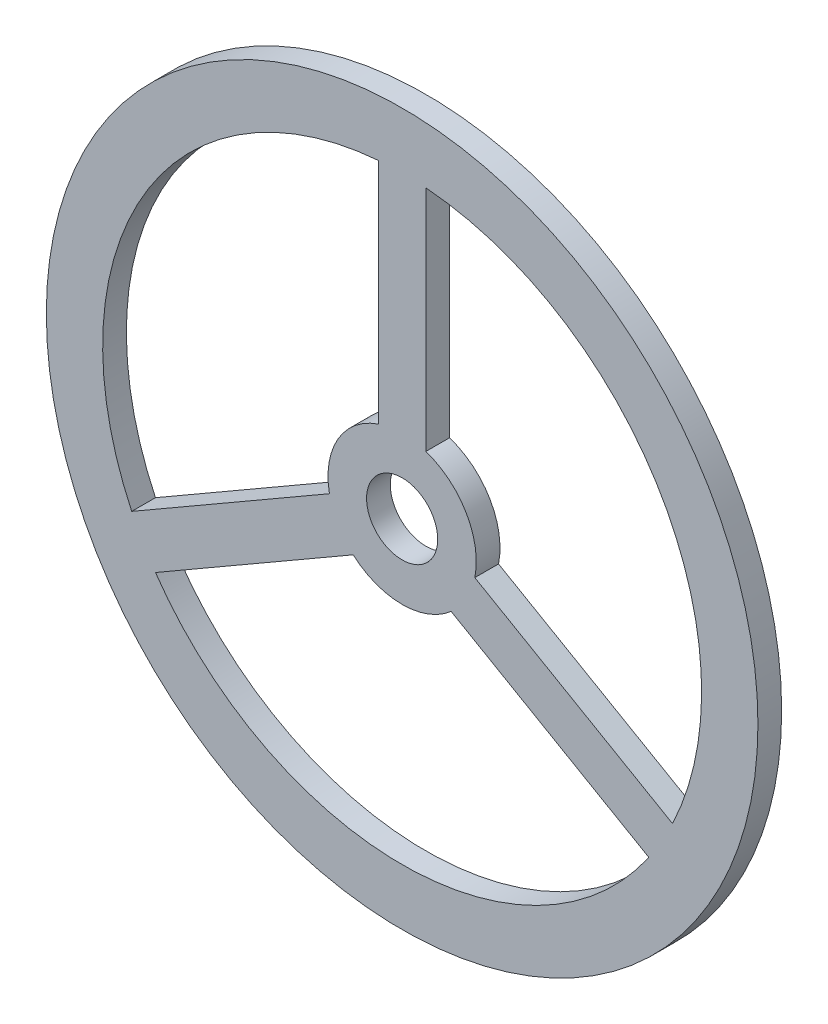
ISO-10303-21;
HEADER;
FILE_DESCRIPTION(('STEP AP214'),'2;1');
FILE_NAME('part.step','',(''),(''),'','','');
FILE_SCHEMA(('AUTOMOTIVE_DESIGN { 1 0 10303 214 1 1 1 1 }'));
ENDSEC;
DATA;
#1=APPLICATION_CONTEXT('core data for automotive mechanical design processes');
#2=APPLICATION_PROTOCOL_DEFINITION('international standard','automotive_design',2000,#1);
#3=PRODUCT_CONTEXT('',#1,'mechanical');
#4=PRODUCT('Part','Part','',(#3));
#5=PRODUCT_RELATED_PRODUCT_CATEGORY('part','',(#4));
#6=PRODUCT_DEFINITION_FORMATION('','',#4);
#7=PRODUCT_DEFINITION_CONTEXT('part definition',#1,'design');
#8=PRODUCT_DEFINITION('design','',#6,#7);
#9=PRODUCT_DEFINITION_SHAPE('','',#8);
#10=(LENGTH_UNIT() NAMED_UNIT(*) SI_UNIT(.MILLI.,.METRE.));
#11=(NAMED_UNIT(*) PLANE_ANGLE_UNIT() SI_UNIT($,.RADIAN.));
#12=(NAMED_UNIT(*) SI_UNIT($,.STERADIAN.) SOLID_ANGLE_UNIT());
#13=UNCERTAINTY_MEASURE_WITH_UNIT(LENGTH_MEASURE(1.E-05),#10,'distance_accuracy_value','');
#14=(GEOMETRIC_REPRESENTATION_CONTEXT(3) GLOBAL_UNCERTAINTY_ASSIGNED_CONTEXT((#13)) GLOBAL_UNIT_ASSIGNED_CONTEXT((#10,
#11,#12)) REPRESENTATION_CONTEXT('',''));
#15=CARTESIAN_POINT('',(0.,0.,0.));
#16=DIRECTION('',(0.,0.,1.));
#17=DIRECTION('',(1.,0.,0.));
#18=AXIS2_PLACEMENT_3D('',#15,#16,#17);
#19=CARTESIAN_POINT('',(0.,0.,4.));
#20=DIRECTION('',(0.,0.,1.));
#21=DIRECTION('',(1.,0.,0.));
#22=AXIS2_PLACEMENT_3D('',#19,#20,#21);
#23=PLANE('',#22);
#24=CARTESIAN_POINT('',(0.,0.,4.));
#25=DIRECTION('',(0.,0.,1.));
#26=DIRECTION('',(1.,0.,0.));
#27=AXIS2_PLACEMENT_3D('',#24,#25,#26);
#28=CIRCLE('',#27,60.);
#29=CARTESIAN_POINT('',(60.,0.,4.));
#30=VERTEX_POINT('',#29);
#31=EDGE_CURVE('E11',#30,#30,#28,.T.);
#32=ORIENTED_EDGE('',*,*,#31,.T.);
#33=EDGE_LOOP('',(#32));
#34=FACE_BOUND('',#33,.T.);
#35=CARTESIAN_POINT('',(0.,0.,4.));
#36=DIRECTION('',(0.,0.,1.));
#37=DIRECTION('',(1.,0.,0.));
#38=AXIS2_PLACEMENT_3D('',#35,#36,#37);
#39=CIRCLE('',#38,6.);
#40=CARTESIAN_POINT('',(6.,0.,4.));
#41=VERTEX_POINT('',#40);
#42=EDGE_CURVE('E219',#41,#41,#39,.T.);
#43=ORIENTED_EDGE('',*,*,#42,.F.);
#44=EDGE_LOOP('',(#43));
#45=FACE_BOUND('',#44,.T.);
#46=DIRECTION('',(0.,1.,0.));
#47=VECTOR('',#46,1.);
#48=CARTESIAN_POINT('',(-4.,11.842719282327,4.));
#49=LINE('',#48,#47);
#50=CARTESIAN_POINT('',(-4.,11.842719282327,4.));
#51=VERTEX_POINT('',#50);
#52=CARTESIAN_POINT('',(-4.,50.3413349048275,4.));
#53=VERTEX_POINT('',#52);
#54=EDGE_CURVE('E190',#51,#53,#49,.T.);
#55=ORIENTED_EDGE('',*,*,#54,.F.);
#56=CARTESIAN_POINT('',(0.,0.,4.));
#57=DIRECTION('',(0.,0.,-1.));
#58=DIRECTION('',(1.,0.,0.));
#59=AXIS2_PLACEMENT_3D('',#56,#57,#58);
#60=CIRCLE('',#59,12.5);
#61=CARTESIAN_POINT('',(-12.256095748383,-2.45725802602564,4.));
#62=VERTEX_POINT('',#61);
#63=EDGE_CURVE('E188',#62,#51,#60,.T.);
#64=ORIENTED_EDGE('',*,*,#63,.F.);
#65=DIRECTION('',(0.866025403784437,0.500000000000003,0.));
#66=VECTOR('',#65,1.);
#67=CARTESIAN_POINT('',(-12.256095748383,-2.45725802602564,4.));
#68=LINE('',#67,#66);
#69=CARTESIAN_POINT('',(-45.5968748880008,-21.706565837276,4.));
#70=VERTEX_POINT('',#69);
#71=EDGE_CURVE('E196',#70,#62,#68,.T.);
#72=ORIENTED_EDGE('',*,*,#71,.F.);
#73=CARTESIAN_POINT('',(0.,0.,4.));
#74=DIRECTION('',(0.,0.,1.));
#75=DIRECTION('',(1.,0.,0.));
#76=AXIS2_PLACEMENT_3D('',#73,#74,#75);
#77=CIRCLE('',#76,50.5);
#78=EDGE_CURVE('E193',#53,#70,#77,.T.);
#79=ORIENTED_EDGE('',*,*,#78,.F.);
#80=EDGE_LOOP('',(#55,#64,#72,#79));
#81=FACE_BOUND('',#80,.T.);
#82=DIRECTION('',(0.866025403784439,-0.499999999999998,0.));
#83=VECTOR('',#82,1.);
#84=CARTESIAN_POINT('',(12.256095748383,-2.45725802602581,4.));
#85=LINE('',#84,#83);
#86=CARTESIAN_POINT('',(12.256095748383,-2.45725802602581,4.));
#87=VERTEX_POINT('',#86);
#88=CARTESIAN_POINT('',(45.5968748880009,-21.706565837276,4.));
#89=VERTEX_POINT('',#88);
#90=EDGE_CURVE('E159',#87,#89,#85,.T.);
#91=ORIENTED_EDGE('',*,*,#90,.F.);
#92=CARTESIAN_POINT('',(0.,0.,4.));
#93=DIRECTION('',(0.,0.,-1.));
#94=DIRECTION('',(1.,0.,0.));
#95=AXIS2_PLACEMENT_3D('',#92,#93,#94);
#96=CIRCLE('',#95,12.5);
#97=CARTESIAN_POINT('',(4.,11.842719282327,4.));
#98=VERTEX_POINT('',#97);
#99=EDGE_CURVE('E157',#98,#87,#96,.T.);
#100=ORIENTED_EDGE('',*,*,#99,.F.);
#101=DIRECTION('',(0.,-1.,0.));
#102=VECTOR('',#101,1.);
#103=CARTESIAN_POINT('',(4.,11.842719282327,4.));
#104=LINE('',#103,#102);
#105=CARTESIAN_POINT('',(4.,50.3413349048275,4.));
#106=VERTEX_POINT('',#105);
#107=EDGE_CURVE('E165',#106,#98,#104,.T.);
#108=ORIENTED_EDGE('',*,*,#107,.F.);
#109=CARTESIAN_POINT('',(0.,0.,4.));
#110=DIRECTION('',(0.,0.,1.));
#111=DIRECTION('',(1.,0.,0.));
#112=AXIS2_PLACEMENT_3D('',#109,#110,#111);
#113=CIRCLE('',#112,50.5);
#114=EDGE_CURVE('E162',#89,#106,#113,.T.);
#115=ORIENTED_EDGE('',*,*,#114,.F.);
#116=EDGE_LOOP('',(#91,#100,#108,#115));
#117=FACE_BOUND('',#116,.T.);
#118=DIRECTION('',(-0.866025403784437,-0.500000000000003,0.));
#119=VECTOR('',#118,1.);
#120=CARTESIAN_POINT('',(-8.2560957483831,-9.38546125630118,4.));
#121=LINE('',#120,#119);
#122=CARTESIAN_POINT('',(-8.2560957483831,-9.38546125630118,4.));
#123=VERTEX_POINT('',#122);
#124=CARTESIAN_POINT('',(-41.5968748880009,-28.6347690675515,4.));
#125=VERTEX_POINT('',#124);
#126=EDGE_CURVE('E129',#123,#125,#121,.T.);
#127=ORIENTED_EDGE('',*,*,#126,.F.);
#128=CARTESIAN_POINT('',(0.,0.,4.));
#129=DIRECTION('',(0.,0.,-1.));
#130=DIRECTION('',(1.,0.,0.));
#131=AXIS2_PLACEMENT_3D('',#128,#129,#130);
#132=CIRCLE('',#131,12.5);
#133=CARTESIAN_POINT('',(8.25609574838296,-9.3854612563013,4.));
#134=VERTEX_POINT('',#133);
#135=EDGE_CURVE('E121',#134,#123,#132,.T.);
#136=ORIENTED_EDGE('',*,*,#135,.F.);
#137=DIRECTION('',(-0.86602540378444,0.499999999999998,0.));
#138=VECTOR('',#137,1.);
#139=CARTESIAN_POINT('',(8.25609574838296,-9.3854612563013,4.));
#140=LINE('',#139,#138);
#141=CARTESIAN_POINT('',(41.5968748880009,-28.6347690675515,4.));
#142=VERTEX_POINT('',#141);
#143=EDGE_CURVE('E143',#142,#134,#140,.T.);
#144=ORIENTED_EDGE('',*,*,#143,.F.);
#145=CARTESIAN_POINT('',(0.,0.,4.));
#146=DIRECTION('',(0.,0.,1.));
#147=DIRECTION('',(1.,0.,0.));
#148=AXIS2_PLACEMENT_3D('',#145,#146,#147);
#149=CIRCLE('',#148,50.5);
#150=EDGE_CURVE('E141',#125,#142,#149,.T.);
#151=ORIENTED_EDGE('',*,*,#150,.F.);
#152=EDGE_LOOP('',(#127,#136,#144,#151));
#153=FACE_BOUND('',#152,.T.);
#154=ADVANCED_FACE('F32',(#34,#45,#81,#117,#153),#23,.T.);
#155=CARTESIAN_POINT('',(0.,0.,0.));
#156=DIRECTION('',(0.,0.,1.));
#157=DIRECTION('',(1.,0.,0.));
#158=AXIS2_PLACEMENT_3D('',#155,#156,#157);
#159=PLANE('',#158);
#160=CARTESIAN_POINT('',(0.,0.,0.));
#161=DIRECTION('',(0.,0.,-1.));
#162=DIRECTION('',(1.,0.,0.));
#163=AXIS2_PLACEMENT_3D('',#160,#161,#162);
#164=CIRCLE('',#163,12.5);
#165=CARTESIAN_POINT('',(4.,11.842719282327,0.));
#166=VERTEX_POINT('',#165);
#167=CARTESIAN_POINT('',(12.256095748383,-2.45725802602581,0.));
#168=VERTEX_POINT('',#167);
#169=EDGE_CURVE('E137',#166,#168,#164,.T.);
#170=ORIENTED_EDGE('',*,*,#169,.T.);
#171=DIRECTION('',(0.866025403784439,-0.499999999999998,0.));
#172=VECTOR('',#171,1.);
#173=CARTESIAN_POINT('',(12.256095748383,-2.45725802602581,0.));
#174=LINE('',#173,#172);
#175=CARTESIAN_POINT('',(45.5968748880009,-21.706565837276,0.));
#176=VERTEX_POINT('',#175);
#177=EDGE_CURVE('E170',#168,#176,#174,.T.);
#178=ORIENTED_EDGE('',*,*,#177,.T.);
#179=CARTESIAN_POINT('',(0.,0.,0.));
#180=DIRECTION('',(0.,0.,1.));
#181=DIRECTION('',(1.,0.,0.));
#182=AXIS2_PLACEMENT_3D('',#179,#180,#181);
#183=CIRCLE('',#182,50.5);
#184=CARTESIAN_POINT('',(4.,50.3413349048275,0.));
#185=VERTEX_POINT('',#184);
#186=EDGE_CURVE('E173',#176,#185,#183,.T.);
#187=ORIENTED_EDGE('',*,*,#186,.T.);
#188=DIRECTION('',(0.,-1.,0.));
#189=VECTOR('',#188,1.);
#190=CARTESIAN_POINT('',(4.,11.842719282327,0.));
#191=LINE('',#190,#189);
#192=EDGE_CURVE('E160',#185,#166,#191,.T.);
#193=ORIENTED_EDGE('',*,*,#192,.T.);
#194=EDGE_LOOP('',(#170,#178,#187,#193));
#195=FACE_BOUND('',#194,.T.);
#196=CARTESIAN_POINT('',(0.,0.,0.));
#197=DIRECTION('',(0.,0.,1.));
#198=DIRECTION('',(1.,0.,0.));
#199=AXIS2_PLACEMENT_3D('',#196,#197,#198);
#200=CIRCLE('',#199,6.);
#201=CARTESIAN_POINT('',(6.,0.,0.));
#202=VERTEX_POINT('',#201);
#203=EDGE_CURVE('E218',#202,#202,#200,.T.);
#204=ORIENTED_EDGE('',*,*,#203,.T.);
#205=EDGE_LOOP('',(#204));
#206=FACE_BOUND('',#205,.T.);
#207=CARTESIAN_POINT('',(0.,0.,0.));
#208=DIRECTION('',(0.,0.,1.));
#209=DIRECTION('',(1.,0.,0.));
#210=AXIS2_PLACEMENT_3D('',#207,#208,#209);
#211=CIRCLE('',#210,60.);
#212=CARTESIAN_POINT('',(60.,0.,0.));
#213=VERTEX_POINT('',#212);
#214=EDGE_CURVE('E36',#213,#213,#211,.T.);
#215=ORIENTED_EDGE('',*,*,#214,.F.);
#216=EDGE_LOOP('',(#215));
#217=FACE_BOUND('',#216,.T.);
#218=CARTESIAN_POINT('',(0.,0.,0.));
#219=DIRECTION('',(0.,0.,-1.));
#220=DIRECTION('',(1.,0.,0.));
#221=AXIS2_PLACEMENT_3D('',#218,#219,#220);
#222=CIRCLE('',#221,12.5);
#223=CARTESIAN_POINT('',(-12.256095748383,-2.45725802602564,0.));
#224=VERTEX_POINT('',#223);
#225=CARTESIAN_POINT('',(-4.,11.842719282327,0.));
#226=VERTEX_POINT('',#225);
#227=EDGE_CURVE('E187',#224,#226,#222,.T.);
#228=ORIENTED_EDGE('',*,*,#227,.T.);
#229=DIRECTION('',(0.,1.,0.));
#230=VECTOR('',#229,1.);
#231=CARTESIAN_POINT('',(-4.,11.842719282327,0.));
#232=LINE('',#231,#230);
#233=CARTESIAN_POINT('',(-4.,50.3413349048275,0.));
#234=VERTEX_POINT('',#233);
#235=EDGE_CURVE('E201',#226,#234,#232,.T.);
#236=ORIENTED_EDGE('',*,*,#235,.T.);
#237=CARTESIAN_POINT('',(0.,0.,0.));
#238=DIRECTION('',(0.,0.,1.));
#239=DIRECTION('',(1.,0.,0.));
#240=AXIS2_PLACEMENT_3D('',#237,#238,#239);
#241=CIRCLE('',#240,50.5);
#242=CARTESIAN_POINT('',(-45.5968748880008,-21.706565837276,0.));
#243=VERTEX_POINT('',#242);
#244=EDGE_CURVE('E204',#234,#243,#241,.T.);
#245=ORIENTED_EDGE('',*,*,#244,.T.);
#246=DIRECTION('',(0.866025403784437,0.500000000000003,0.));
#247=VECTOR('',#246,1.);
#248=CARTESIAN_POINT('',(-12.256095748383,-2.45725802602564,0.));
#249=LINE('',#248,#247);
#250=EDGE_CURVE('E191',#243,#224,#249,.T.);
#251=ORIENTED_EDGE('',*,*,#250,.T.);
#252=EDGE_LOOP('',(#228,#236,#245,#251));
#253=FACE_BOUND('',#252,.T.);
#254=CARTESIAN_POINT('',(0.,0.,0.));
#255=DIRECTION('',(0.,0.,-1.));
#256=DIRECTION('',(1.,0.,0.));
#257=AXIS2_PLACEMENT_3D('',#254,#255,#256);
#258=CIRCLE('',#257,12.5);
#259=CARTESIAN_POINT('',(8.25609574838296,-9.3854612563013,0.));
#260=VERTEX_POINT('',#259);
#261=CARTESIAN_POINT('',(-8.2560957483831,-9.38546125630118,0.));
#262=VERTEX_POINT('',#261);
#263=EDGE_CURVE('E55',#260,#262,#258,.T.);
#264=ORIENTED_EDGE('',*,*,#263,.T.);
#265=DIRECTION('',(-0.866025403784437,-0.500000000000003,0.));
#266=VECTOR('',#265,1.);
#267=CARTESIAN_POINT('',(-8.2560957483831,-9.38546125630118,0.));
#268=LINE('',#267,#266);
#269=CARTESIAN_POINT('',(-41.5968748880009,-28.6347690675515,0.));
#270=VERTEX_POINT('',#269);
#271=EDGE_CURVE('E136',#262,#270,#268,.T.);
#272=ORIENTED_EDGE('',*,*,#271,.T.);
#273=CARTESIAN_POINT('',(0.,0.,0.));
#274=DIRECTION('',(0.,0.,1.));
#275=DIRECTION('',(1.,0.,0.));
#276=AXIS2_PLACEMENT_3D('',#273,#274,#275);
#277=CIRCLE('',#276,50.5);
#278=CARTESIAN_POINT('',(41.5968748880009,-28.6347690675515,0.));
#279=VERTEX_POINT('',#278);
#280=EDGE_CURVE('E149',#270,#279,#277,.T.);
#281=ORIENTED_EDGE('',*,*,#280,.T.);
#282=DIRECTION('',(-0.86602540378444,0.499999999999998,0.));
#283=VECTOR('',#282,1.);
#284=CARTESIAN_POINT('',(8.25609574838296,-9.3854612563013,0.));
#285=LINE('',#284,#283);
#286=EDGE_CURVE('E130',#279,#260,#285,.T.);
#287=ORIENTED_EDGE('',*,*,#286,.T.);
#288=EDGE_LOOP('',(#264,#272,#281,#287));
#289=FACE_BOUND('',#288,.T.);
#290=ADVANCED_FACE('F225',(#195,#206,#217,#253,#289),#159,.F.);
#291=CARTESIAN_POINT('',(0.,0.,4.));
#292=DIRECTION('',(0.,0.,-1.));
#293=DIRECTION('',(-1.,0.,0.));
#294=AXIS2_PLACEMENT_3D('',#291,#292,#293);
#295=CYLINDRICAL_SURFACE('',#294,60.);
#296=ORIENTED_EDGE('',*,*,#31,.F.);
#297=EDGE_LOOP('',(#296));
#298=FACE_BOUND('',#297,.T.);
#299=ORIENTED_EDGE('',*,*,#214,.T.);
#300=EDGE_LOOP('',(#299));
#301=FACE_BOUND('',#300,.T.);
#302=ADVANCED_FACE('F34',(#298,#301),#295,.T.);
#303=CARTESIAN_POINT('',(0.,0.,4.));
#304=DIRECTION('',(0.,0.,-1.));
#305=DIRECTION('',(-1.,0.,0.));
#306=AXIS2_PLACEMENT_3D('',#303,#304,#305);
#307=CYLINDRICAL_SURFACE('',#306,6.);
#308=ORIENTED_EDGE('',*,*,#42,.T.);
#309=EDGE_LOOP('',(#308));
#310=FACE_BOUND('',#309,.T.);
#311=ORIENTED_EDGE('',*,*,#203,.F.);
#312=EDGE_LOOP('',(#311));
#313=FACE_BOUND('',#312,.T.);
#314=ADVANCED_FACE('F228',(#310,#313),#307,.F.);
#315=CARTESIAN_POINT('',(0.,0.,4.));
#316=DIRECTION('',(0.,0.,-1.));
#317=DIRECTION('',(-1.,0.,0.));
#318=AXIS2_PLACEMENT_3D('',#315,#316,#317);
#319=CYLINDRICAL_SURFACE('',#318,12.5);
#320=ORIENTED_EDGE('',*,*,#227,.F.);
#321=DIRECTION('',(0.,0.,-1.));
#322=VECTOR('',#321,1.);
#323=CARTESIAN_POINT('',(-12.256095748383,-2.45725802602564,4.));
#324=LINE('',#323,#322);
#325=EDGE_CURVE('E198',#62,#224,#324,.T.);
#326=ORIENTED_EDGE('',*,*,#325,.F.);
#327=ORIENTED_EDGE('',*,*,#63,.T.);
#328=DIRECTION('',(0.,0.,-1.));
#329=VECTOR('',#328,1.);
#330=CARTESIAN_POINT('',(-4.,11.842719282327,4.));
#331=LINE('',#330,#329);
#332=EDGE_CURVE('E215',#51,#226,#331,.T.);
#333=ORIENTED_EDGE('',*,*,#332,.T.);
#334=EDGE_LOOP('',(#320,#326,#327,#333));
#335=FACE_BOUND('',#334,.T.);
#336=ADVANCED_FACE('F230',(#335),#319,.T.);
#337=CARTESIAN_POINT('',(-4.,11.842719282327,4.));
#338=DIRECTION('',(-1.,0.,0.));
#339=DIRECTION('',(0.,0.,1.));
#340=AXIS2_PLACEMENT_3D('',#337,#338,#339);
#341=PLANE('',#340);
#342=ORIENTED_EDGE('',*,*,#235,.F.);
#343=ORIENTED_EDGE('',*,*,#332,.F.);
#344=ORIENTED_EDGE('',*,*,#54,.T.);
#345=DIRECTION('',(0.,0.,-1.));
#346=VECTOR('',#345,1.);
#347=CARTESIAN_POINT('',(-4.,50.3413349048275,4.));
#348=LINE('',#347,#346);
#349=EDGE_CURVE('E213',#53,#234,#348,.T.);
#350=ORIENTED_EDGE('',*,*,#349,.T.);
#351=EDGE_LOOP('',(#342,#343,#344,#350));
#352=FACE_BOUND('',#351,.T.);
#353=ADVANCED_FACE('F237',(#352),#341,.T.);
#354=CARTESIAN_POINT('',(0.,0.,4.));
#355=DIRECTION('',(0.,0.,-1.));
#356=DIRECTION('',(-1.,0.,0.));
#357=AXIS2_PLACEMENT_3D('',#354,#355,#356);
#358=CYLINDRICAL_SURFACE('',#357,50.5);
#359=ORIENTED_EDGE('',*,*,#244,.F.);
#360=ORIENTED_EDGE('',*,*,#349,.F.);
#361=ORIENTED_EDGE('',*,*,#78,.T.);
#362=DIRECTION('',(0.,0.,-1.));
#363=VECTOR('',#362,1.);
#364=CARTESIAN_POINT('',(-45.5968748880008,-21.706565837276,4.));
#365=LINE('',#364,#363);
#366=EDGE_CURVE('E211',#70,#243,#365,.T.);
#367=ORIENTED_EDGE('',*,*,#366,.T.);
#368=EDGE_LOOP('',(#359,#360,#361,#367));
#369=FACE_BOUND('',#368,.T.);
#370=ADVANCED_FACE('F290',(#369),#358,.F.);
#371=CARTESIAN_POINT('',(-12.256095748383,-2.45725802602564,4.));
#372=DIRECTION('',(-0.500000000000003,0.866025403784437,0.));
#373=DIRECTION('',(-0.866025403784437,-0.500000000000003,0.));
#374=AXIS2_PLACEMENT_3D('',#371,#372,#373);
#375=PLANE('',#374);
#376=ORIENTED_EDGE('',*,*,#250,.F.);
#377=ORIENTED_EDGE('',*,*,#366,.F.);
#378=ORIENTED_EDGE('',*,*,#71,.T.);
#379=ORIENTED_EDGE('',*,*,#325,.T.);
#380=EDGE_LOOP('',(#376,#377,#378,#379));
#381=FACE_BOUND('',#380,.T.);
#382=ADVANCED_FACE('F287',(#381),#375,.T.);
#383=CARTESIAN_POINT('',(0.,0.,4.));
#384=DIRECTION('',(0.,0.,-1.));
#385=DIRECTION('',(-1.,0.,0.));
#386=AXIS2_PLACEMENT_3D('',#383,#384,#385);
#387=CYLINDRICAL_SURFACE('',#386,12.5);
#388=ORIENTED_EDGE('',*,*,#169,.F.);
#389=DIRECTION('',(0.,0.,-1.));
#390=VECTOR('',#389,1.);
#391=CARTESIAN_POINT('',(4.,11.842719282327,4.));
#392=LINE('',#391,#390);
#393=EDGE_CURVE('E167',#98,#166,#392,.T.);
#394=ORIENTED_EDGE('',*,*,#393,.F.);
#395=ORIENTED_EDGE('',*,*,#99,.T.);
#396=DIRECTION('',(0.,0.,-1.));
#397=VECTOR('',#396,1.);
#398=CARTESIAN_POINT('',(12.256095748383,-2.45725802602581,4.));
#399=LINE('',#398,#397);
#400=EDGE_CURVE('E184',#87,#168,#399,.T.);
#401=ORIENTED_EDGE('',*,*,#400,.T.);
#402=EDGE_LOOP('',(#388,#394,#395,#401));
#403=FACE_BOUND('',#402,.T.);
#404=ADVANCED_FACE('F269',(#403),#387,.T.);
#405=CARTESIAN_POINT('',(12.256095748383,-2.45725802602581,4.));
#406=DIRECTION('',(0.499999999999999,0.86602540378444,0.));
#407=DIRECTION('',(-0.866025403784439,0.499999999999998,0.));
#408=AXIS2_PLACEMENT_3D('',#405,#406,#407);
#409=PLANE('',#408);
#410=ORIENTED_EDGE('',*,*,#177,.F.);
#411=ORIENTED_EDGE('',*,*,#400,.F.);
#412=ORIENTED_EDGE('',*,*,#90,.T.);
#413=DIRECTION('',(0.,0.,-1.));
#414=VECTOR('',#413,1.);
#415=CARTESIAN_POINT('',(45.5968748880009,-21.706565837276,4.));
#416=LINE('',#415,#414);
#417=EDGE_CURVE('E182',#89,#176,#416,.T.);
#418=ORIENTED_EDGE('',*,*,#417,.T.);
#419=EDGE_LOOP('',(#410,#411,#412,#418));
#420=FACE_BOUND('',#419,.T.);
#421=ADVANCED_FACE('F263',(#420),#409,.T.);
#422=CARTESIAN_POINT('',(0.,0.,4.));
#423=DIRECTION('',(0.,0.,-1.));
#424=DIRECTION('',(-1.,0.,0.));
#425=AXIS2_PLACEMENT_3D('',#422,#423,#424);
#426=CYLINDRICAL_SURFACE('',#425,50.5);
#427=ORIENTED_EDGE('',*,*,#186,.F.);
#428=ORIENTED_EDGE('',*,*,#417,.F.);
#429=ORIENTED_EDGE('',*,*,#114,.T.);
#430=DIRECTION('',(0.,0.,-1.));
#431=VECTOR('',#430,1.);
#432=CARTESIAN_POINT('',(4.,50.3413349048275,4.));
#433=LINE('',#432,#431);
#434=EDGE_CURVE('E180',#106,#185,#433,.T.);
#435=ORIENTED_EDGE('',*,*,#434,.T.);
#436=EDGE_LOOP('',(#427,#428,#429,#435));
#437=FACE_BOUND('',#436,.T.);
#438=ADVANCED_FACE('F266',(#437),#426,.F.);
#439=CARTESIAN_POINT('',(4.,11.842719282327,4.));
#440=DIRECTION('',(1.,0.,0.));
#441=DIRECTION('',(0.,0.,-1.));
#442=AXIS2_PLACEMENT_3D('',#439,#440,#441);
#443=PLANE('',#442);
#444=ORIENTED_EDGE('',*,*,#192,.F.);
#445=ORIENTED_EDGE('',*,*,#434,.F.);
#446=ORIENTED_EDGE('',*,*,#107,.T.);
#447=ORIENTED_EDGE('',*,*,#393,.T.);
#448=EDGE_LOOP('',(#444,#445,#446,#447));
#449=FACE_BOUND('',#448,.T.);
#450=ADVANCED_FACE('F272',(#449),#443,.T.);
#451=CARTESIAN_POINT('',(0.,0.,4.));
#452=DIRECTION('',(0.,0.,-1.));
#453=DIRECTION('',(-1.,0.,0.));
#454=AXIS2_PLACEMENT_3D('',#451,#452,#453);
#455=CYLINDRICAL_SURFACE('',#454,12.5);
#456=ORIENTED_EDGE('',*,*,#263,.F.);
#457=DIRECTION('',(0.,0.,-1.));
#458=VECTOR('',#457,1.);
#459=CARTESIAN_POINT('',(8.25609574838296,-9.3854612563013,4.));
#460=LINE('',#459,#458);
#461=EDGE_CURVE('E125',#134,#260,#460,.T.);
#462=ORIENTED_EDGE('',*,*,#461,.F.);
#463=ORIENTED_EDGE('',*,*,#135,.T.);
#464=DIRECTION('',(0.,0.,-1.));
#465=VECTOR('',#464,1.);
#466=CARTESIAN_POINT('',(-8.2560957483831,-9.38546125630118,4.));
#467=LINE('',#466,#465);
#468=EDGE_CURVE('E124',#123,#262,#467,.T.);
#469=ORIENTED_EDGE('',*,*,#468,.T.);
#470=EDGE_LOOP('',(#456,#462,#463,#469));
#471=FACE_BOUND('',#470,.T.);
#472=ADVANCED_FACE('F123',(#471),#455,.T.);
#473=CARTESIAN_POINT('',(-8.2560957483831,-9.38546125630118,4.));
#474=DIRECTION('',(0.500000000000003,-0.866025403784437,0.));
#475=DIRECTION('',(0.866025403784437,0.500000000000003,0.));
#476=AXIS2_PLACEMENT_3D('',#473,#474,#475);
#477=PLANE('',#476);
#478=ORIENTED_EDGE('',*,*,#271,.F.);
#479=ORIENTED_EDGE('',*,*,#468,.F.);
#480=ORIENTED_EDGE('',*,*,#126,.T.);
#481=DIRECTION('',(0.,0.,-1.));
#482=VECTOR('',#481,1.);
#483=CARTESIAN_POINT('',(-41.5968748880009,-28.6347690675515,4.));
#484=LINE('',#483,#482);
#485=EDGE_CURVE('E138',#125,#270,#484,.T.);
#486=ORIENTED_EDGE('',*,*,#485,.T.);
#487=EDGE_LOOP('',(#478,#479,#480,#486));
#488=FACE_BOUND('',#487,.T.);
#489=ADVANCED_FACE('F133',(#488),#477,.T.);
#490=CARTESIAN_POINT('',(0.,0.,4.));
#491=DIRECTION('',(0.,0.,-1.));
#492=DIRECTION('',(-1.,0.,0.));
#493=AXIS2_PLACEMENT_3D('',#490,#491,#492);
#494=CYLINDRICAL_SURFACE('',#493,50.5);
#495=ORIENTED_EDGE('',*,*,#280,.F.);
#496=ORIENTED_EDGE('',*,*,#485,.F.);
#497=ORIENTED_EDGE('',*,*,#150,.T.);
#498=DIRECTION('',(0.,0.,-1.));
#499=VECTOR('',#498,1.);
#500=CARTESIAN_POINT('',(41.5968748880009,-28.6347690675515,4.));
#501=LINE('',#500,#499);
#502=EDGE_CURVE('E47',#142,#279,#501,.T.);
#503=ORIENTED_EDGE('',*,*,#502,.T.);
#504=EDGE_LOOP('',(#495,#496,#497,#503));
#505=FACE_BOUND('',#504,.T.);
#506=ADVANCED_FACE('F310',(#505),#494,.F.);
#507=CARTESIAN_POINT('',(8.25609574838296,-9.3854612563013,4.));
#508=DIRECTION('',(-0.499999999999998,-0.86602540378444,0.));
#509=DIRECTION('',(0.86602540378444,-0.499999999999998,0.));
#510=AXIS2_PLACEMENT_3D('',#507,#508,#509);
#511=PLANE('',#510);
#512=ORIENTED_EDGE('',*,*,#286,.F.);
#513=ORIENTED_EDGE('',*,*,#502,.F.);
#514=ORIENTED_EDGE('',*,*,#143,.T.);
#515=ORIENTED_EDGE('',*,*,#461,.T.);
#516=EDGE_LOOP('',(#512,#513,#514,#515));
#517=FACE_BOUND('',#516,.T.);
#518=ADVANCED_FACE('F308',(#517),#511,.T.);
#519=CLOSED_SHELL('',(#154,#290,#302,#314,#336,#353,#370,#382,#404,#421,#438,#450,#472,#489,
#506,#518));
#520=MANIFOLD_SOLID_BREP('B2',#519);
#521=ADVANCED_BREP_SHAPE_REPRESENTATION('',(#18,#520),#14);
#522=SHAPE_DEFINITION_REPRESENTATION(#9,#521);
ENDSEC;
END-ISO-10303-21;
